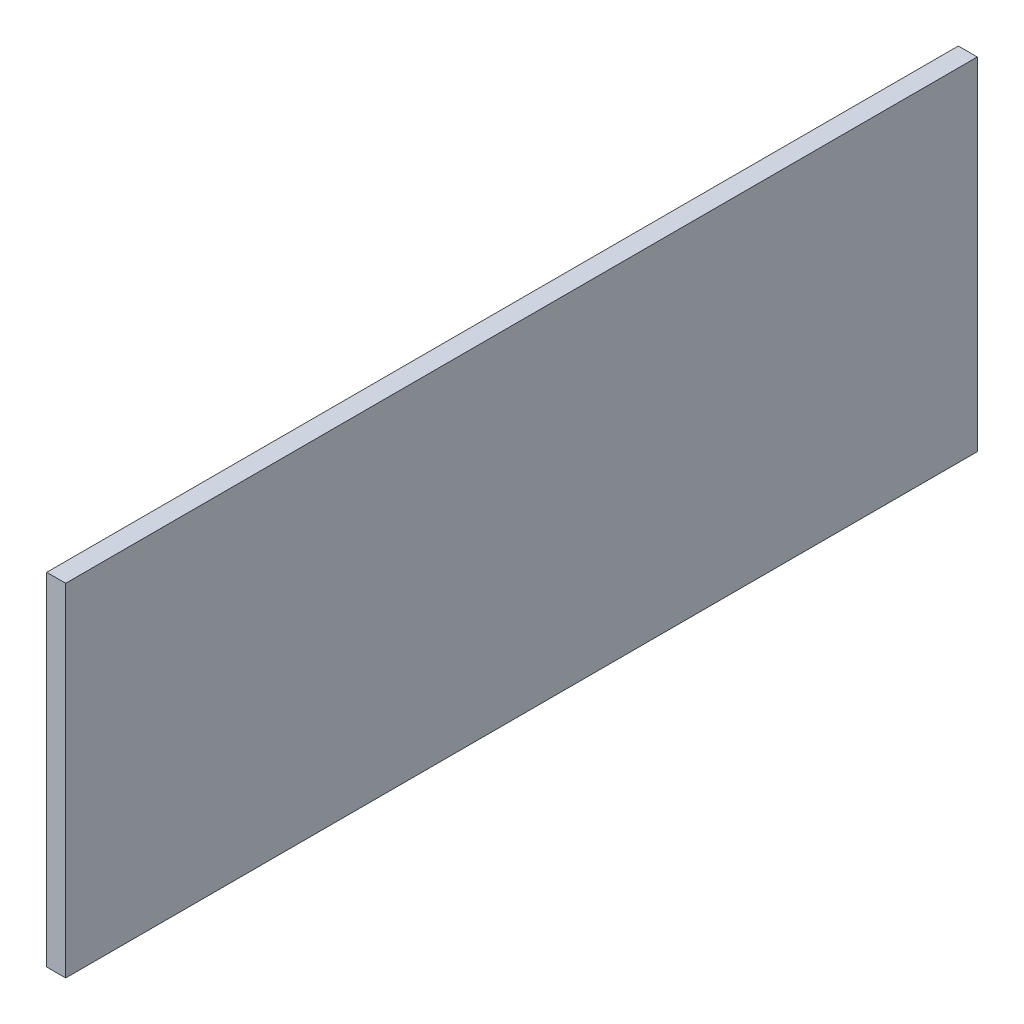
ISO-10303-21;
HEADER;
FILE_DESCRIPTION(('STEP AP214'),'2;1');
FILE_NAME('part.step','',(''),(''),'','','');
FILE_SCHEMA(('AUTOMOTIVE_DESIGN { 1 0 10303 214 1 1 1 1 }'));
ENDSEC;
DATA;
#1=APPLICATION_CONTEXT('core data for automotive mechanical design processes');
#2=APPLICATION_PROTOCOL_DEFINITION('international standard','automotive_design',2000,#1);
#3=PRODUCT_CONTEXT('',#1,'mechanical');
#4=PRODUCT('Part','Part','',(#3));
#5=PRODUCT_RELATED_PRODUCT_CATEGORY('part','',(#4));
#6=PRODUCT_DEFINITION_FORMATION('','',#4);
#7=PRODUCT_DEFINITION_CONTEXT('part definition',#1,'design');
#8=PRODUCT_DEFINITION('design','',#6,#7);
#9=PRODUCT_DEFINITION_SHAPE('','',#8);
#10=(LENGTH_UNIT() NAMED_UNIT(*) SI_UNIT(.MILLI.,.METRE.));
#11=(NAMED_UNIT(*) PLANE_ANGLE_UNIT() SI_UNIT($,.RADIAN.));
#12=(NAMED_UNIT(*) SI_UNIT($,.STERADIAN.) SOLID_ANGLE_UNIT());
#13=UNCERTAINTY_MEASURE_WITH_UNIT(LENGTH_MEASURE(1.E-05),#10,'distance_accuracy_value','');
#14=(GEOMETRIC_REPRESENTATION_CONTEXT(3) GLOBAL_UNCERTAINTY_ASSIGNED_CONTEXT((#13)) GLOBAL_UNIT_ASSIGNED_CONTEXT((#10,
#11,#12)) REPRESENTATION_CONTEXT('',''));
#15=CARTESIAN_POINT('',(0.,0.,0.));
#16=DIRECTION('',(0.,0.,1.));
#17=DIRECTION('',(1.,0.,0.));
#18=AXIS2_PLACEMENT_3D('',#15,#16,#17);
#19=CARTESIAN_POINT('',(304.8,0.,0.));
#20=DIRECTION('',(0.,0.,1.));
#21=DIRECTION('',(0.,-1.,0.));
#22=AXIS2_PLACEMENT_3D('',#19,#20,#21);
#23=PLANE('',#22);
#24=DIRECTION('',(0.,1.,0.));
#25=VECTOR('',#24,1.);
#26=CARTESIAN_POINT('',(0.,0.,0.));
#27=LINE('',#26,#25);
#28=CARTESIAN_POINT('',(0.,-5486.4,0.));
#29=VERTEX_POINT('',#28);
#30=CARTESIAN_POINT('',(0.,0.,0.));
#31=VERTEX_POINT('',#30);
#32=EDGE_CURVE('E95',#29,#31,#27,.T.);
#33=ORIENTED_EDGE('',*,*,#32,.T.);
#34=DIRECTION('',(-1.,0.,0.));
#35=VECTOR('',#34,1.);
#36=CARTESIAN_POINT('',(304.8,0.,0.));
#37=LINE('',#36,#35);
#38=CARTESIAN_POINT('',(304.8,0.,0.));
#39=VERTEX_POINT('',#38);
#40=EDGE_CURVE('E11',#39,#31,#37,.T.);
#41=ORIENTED_EDGE('',*,*,#40,.F.);
#42=DIRECTION('',(0.,1.,0.));
#43=VECTOR('',#42,1.);
#44=CARTESIAN_POINT('',(304.8,0.,0.));
#45=LINE('',#44,#43);
#46=CARTESIAN_POINT('',(304.8,-5486.4,0.));
#47=VERTEX_POINT('',#46);
#48=EDGE_CURVE('E83',#47,#39,#45,.T.);
#49=ORIENTED_EDGE('',*,*,#48,.F.);
#50=DIRECTION('',(-1.,0.,0.));
#51=VECTOR('',#50,1.);
#52=CARTESIAN_POINT('',(304.8,-5486.4,0.));
#53=LINE('',#52,#51);
#54=EDGE_CURVE('E91',#47,#29,#53,.T.);
#55=ORIENTED_EDGE('',*,*,#54,.T.);
#56=EDGE_LOOP('',(#33,#41,#49,#55));
#57=FACE_BOUND('',#56,.T.);
#58=ADVANCED_FACE('F32',(#57),#23,.F.);
#59=CARTESIAN_POINT('',(304.8,0.,0.));
#60=DIRECTION('',(0.,-1.,0.));
#61=DIRECTION('',(0.,0.,-1.));
#62=AXIS2_PLACEMENT_3D('',#59,#60,#61);
#63=PLANE('',#62);
#64=DIRECTION('',(0.,0.,1.));
#65=VECTOR('',#64,1.);
#66=CARTESIAN_POINT('',(0.,0.,0.));
#67=LINE('',#66,#65);
#68=CARTESIAN_POINT('',(0.,0.,14630.4));
#69=VERTEX_POINT('',#68);
#70=EDGE_CURVE('E87',#31,#69,#67,.T.);
#71=ORIENTED_EDGE('',*,*,#70,.T.);
#72=DIRECTION('',(-1.,0.,0.));
#73=VECTOR('',#72,1.);
#74=CARTESIAN_POINT('',(304.8,0.,14630.4));
#75=LINE('',#74,#73);
#76=CARTESIAN_POINT('',(304.8,0.,14630.4));
#77=VERTEX_POINT('',#76);
#78=EDGE_CURVE('E40',#77,#69,#75,.T.);
#79=ORIENTED_EDGE('',*,*,#78,.F.);
#80=DIRECTION('',(0.,0.,1.));
#81=VECTOR('',#80,1.);
#82=CARTESIAN_POINT('',(304.8,0.,0.));
#83=LINE('',#82,#81);
#84=EDGE_CURVE('E78',#39,#77,#83,.T.);
#85=ORIENTED_EDGE('',*,*,#84,.F.);
#86=ORIENTED_EDGE('',*,*,#40,.T.);
#87=EDGE_LOOP('',(#71,#79,#85,#86));
#88=FACE_BOUND('',#87,.T.);
#89=ADVANCED_FACE('F86',(#88),#63,.F.);
#90=CARTESIAN_POINT('',(304.8,0.,14630.4));
#91=DIRECTION('',(0.,0.,-1.));
#92=DIRECTION('',(-1.,0.,0.));
#93=AXIS2_PLACEMENT_3D('',#90,#91,#92);
#94=PLANE('',#93);
#95=DIRECTION('',(0.,-1.,0.));
#96=VECTOR('',#95,1.);
#97=CARTESIAN_POINT('',(0.,0.,14630.4));
#98=LINE('',#97,#96);
#99=CARTESIAN_POINT('',(0.,-5486.40000000001,14630.4));
#100=VERTEX_POINT('',#99);
#101=EDGE_CURVE('E65',#69,#100,#98,.T.);
#102=ORIENTED_EDGE('',*,*,#101,.T.);
#103=DIRECTION('',(-1.,0.,0.));
#104=VECTOR('',#103,1.);
#105=CARTESIAN_POINT('',(304.8,-5486.40000000001,14630.4));
#106=LINE('',#105,#104);
#107=CARTESIAN_POINT('',(304.8,-5486.40000000001,14630.4));
#108=VERTEX_POINT('',#107);
#109=EDGE_CURVE('E88',#108,#100,#106,.T.);
#110=ORIENTED_EDGE('',*,*,#109,.F.);
#111=DIRECTION('',(0.,-1.,0.));
#112=VECTOR('',#111,1.);
#113=CARTESIAN_POINT('',(304.8,0.,14630.4));
#114=LINE('',#113,#112);
#115=EDGE_CURVE('E81',#77,#108,#114,.T.);
#116=ORIENTED_EDGE('',*,*,#115,.F.);
#117=ORIENTED_EDGE('',*,*,#78,.T.);
#118=EDGE_LOOP('',(#102,#110,#116,#117));
#119=FACE_BOUND('',#118,.T.);
#120=ADVANCED_FACE('F89',(#119),#94,.F.);
#121=CARTESIAN_POINT('',(304.8,-5486.4,0.));
#122=DIRECTION('',(0.,1.,0.));
#123=DIRECTION('',(0.,0.,1.));
#124=AXIS2_PLACEMENT_3D('',#121,#122,#123);
#125=PLANE('',#124);
#126=DIRECTION('',(0.,0.,-1.));
#127=VECTOR('',#126,1.);
#128=CARTESIAN_POINT('',(0.,-5486.4,0.));
#129=LINE('',#128,#127);
#130=EDGE_CURVE('E71',#100,#29,#129,.T.);
#131=ORIENTED_EDGE('',*,*,#130,.T.);
#132=ORIENTED_EDGE('',*,*,#54,.F.);
#133=DIRECTION('',(0.,0.,-1.));
#134=VECTOR('',#133,1.);
#135=CARTESIAN_POINT('',(304.8,-5486.4,0.));
#136=LINE('',#135,#134);
#137=EDGE_CURVE('E48',#108,#47,#136,.T.);
#138=ORIENTED_EDGE('',*,*,#137,.F.);
#139=ORIENTED_EDGE('',*,*,#109,.T.);
#140=EDGE_LOOP('',(#131,#132,#138,#139));
#141=FACE_BOUND('',#140,.T.);
#142=ADVANCED_FACE('F102',(#141),#125,.F.);
#143=CARTESIAN_POINT('',(304.8,0.,0.));
#144=DIRECTION('',(-1.,0.,0.));
#145=DIRECTION('',(0.,0.,1.));
#146=AXIS2_PLACEMENT_3D('',#143,#144,#145);
#147=PLANE('',#146);
#148=ORIENTED_EDGE('',*,*,#48,.T.);
#149=ORIENTED_EDGE('',*,*,#84,.T.);
#150=ORIENTED_EDGE('',*,*,#115,.T.);
#151=ORIENTED_EDGE('',*,*,#137,.T.);
#152=EDGE_LOOP('',(#148,#149,#150,#151));
#153=FACE_BOUND('',#152,.T.);
#154=ADVANCED_FACE('F79',(#153),#147,.F.);
#155=CARTESIAN_POINT('',(0.,0.,0.));
#156=DIRECTION('',(-1.,0.,0.));
#157=DIRECTION('',(0.,0.,1.));
#158=AXIS2_PLACEMENT_3D('',#155,#156,#157);
#159=PLANE('',#158);
#160=ORIENTED_EDGE('',*,*,#32,.F.);
#161=ORIENTED_EDGE('',*,*,#130,.F.);
#162=ORIENTED_EDGE('',*,*,#101,.F.);
#163=ORIENTED_EDGE('',*,*,#70,.F.);
#164=EDGE_LOOP('',(#160,#161,#162,#163));
#165=FACE_BOUND('',#164,.T.);
#166=ADVANCED_FACE('F105',(#165),#159,.T.);
#167=CLOSED_SHELL('',(#58,#89,#120,#142,#154,#166));
#168=MANIFOLD_SOLID_BREP('B2',#167);
#169=ADVANCED_BREP_SHAPE_REPRESENTATION('',(#18,#168),#14);
#170=SHAPE_DEFINITION_REPRESENTATION(#9,#169);
ENDSEC;
END-ISO-10303-21;
